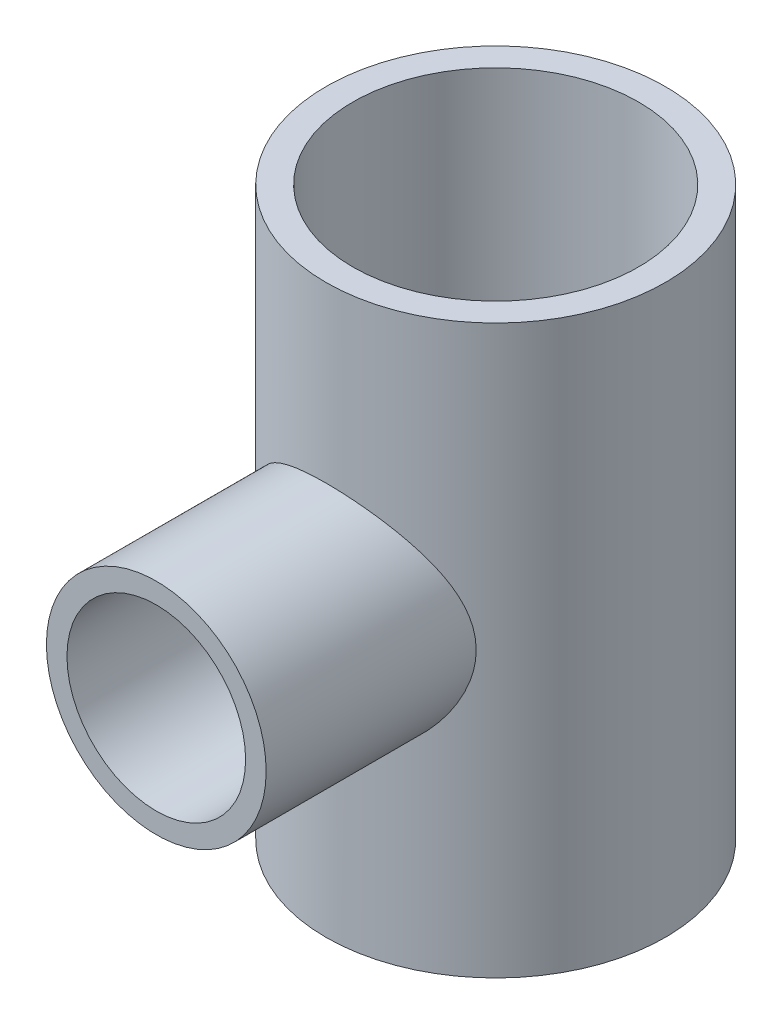
ISO-10303-21;
HEADER;
FILE_DESCRIPTION(('STEP AP214'),'2;1');
FILE_NAME('part.step','',(''),(''),'','','');
FILE_SCHEMA(('AUTOMOTIVE_DESIGN { 1 0 10303 214 1 1 1 1 }'));
ENDSEC;
DATA;
#1=APPLICATION_CONTEXT('core data for automotive mechanical design processes');
#2=APPLICATION_PROTOCOL_DEFINITION('international standard','automotive_design',2000,#1);
#3=PRODUCT_CONTEXT('',#1,'mechanical');
#4=PRODUCT('Part','Part','',(#3));
#5=PRODUCT_RELATED_PRODUCT_CATEGORY('part','',(#4));
#6=PRODUCT_DEFINITION_FORMATION('','',#4);
#7=PRODUCT_DEFINITION_CONTEXT('part definition',#1,'design');
#8=PRODUCT_DEFINITION('design','',#6,#7);
#9=PRODUCT_DEFINITION_SHAPE('','',#8);
#10=(LENGTH_UNIT() NAMED_UNIT(*) SI_UNIT(.MILLI.,.METRE.));
#11=(NAMED_UNIT(*) PLANE_ANGLE_UNIT() SI_UNIT($,.RADIAN.));
#12=(NAMED_UNIT(*) SI_UNIT($,.STERADIAN.) SOLID_ANGLE_UNIT());
#13=UNCERTAINTY_MEASURE_WITH_UNIT(LENGTH_MEASURE(1.E-05),#10,'distance_accuracy_value','');
#14=(GEOMETRIC_REPRESENTATION_CONTEXT(3) GLOBAL_UNCERTAINTY_ASSIGNED_CONTEXT((#13)) GLOBAL_UNIT_ASSIGNED_CONTEXT((#10,
#11,#12)) REPRESENTATION_CONTEXT('',''));
#15=CARTESIAN_POINT('',(0.,0.,0.));
#16=DIRECTION('',(0.,0.,1.));
#17=DIRECTION('',(1.,0.,0.));
#18=AXIS2_PLACEMENT_3D('',#15,#16,#17);
#19=CARTESIAN_POINT('',(0.,63.5,0.));
#20=DIRECTION('',(0.,-1.,0.));
#21=DIRECTION('',(0.,0.,-1.));
#22=AXIS2_PLACEMENT_3D('',#19,#20,#21);
#23=CYLINDRICAL_SURFACE('',#22,19.);
#24=CARTESIAN_POINT('',(0.,0.,0.));
#25=DIRECTION('',(0.,1.,0.));
#26=DIRECTION('',(0.,0.,1.));
#27=AXIS2_PLACEMENT_3D('',#24,#25,#26);
#28=CIRCLE('',#27,19.);
#29=CARTESIAN_POINT('',(0.,0.,19.));
#30=VERTEX_POINT('',#29);
#31=EDGE_CURVE('E50',#30,#30,#28,.T.);
#32=ORIENTED_EDGE('',*,*,#31,.T.);
#33=EDGE_LOOP('',(#32));
#34=FACE_BOUND('',#33,.T.);
#35=CARTESIAN_POINT('',(0.,63.5,0.));
#36=DIRECTION('',(0.,1.,0.));
#37=DIRECTION('',(0.,0.,1.));
#38=AXIS2_PLACEMENT_3D('',#35,#36,#37);
#39=CIRCLE('',#38,19.);
#40=CARTESIAN_POINT('',(0.,63.5,19.));
#41=VERTEX_POINT('',#40);
#42=EDGE_CURVE('E54',#41,#41,#39,.T.);
#43=ORIENTED_EDGE('',*,*,#42,.F.);
#44=EDGE_LOOP('',(#43));
#45=FACE_BOUND('',#44,.T.);
#46=CARTESIAN_POINT('',(-12.3,31.75,14.4813673387564));
#47=CARTESIAN_POINT('',(-12.2999965441653,31.4470628411877,14.4813729801498));
#48=CARTESIAN_POINT('',(-12.2887847818398,31.1440660838692,14.4909163526273));
#49=CARTESIAN_POINT('',(-12.2441618375185,30.5408498386601,14.5286379220476));
#50=CARTESIAN_POINT('',(-12.2107445239723,30.2406311410887,14.5568212659783));
#51=CARTESIAN_POINT('',(-12.1223113113468,29.6451754666948,14.6305457559861));
#52=CARTESIAN_POINT('',(-12.0672672050211,29.3499455232076,14.6761095686727));
#53=CARTESIAN_POINT('',(-11.9365034211611,28.7668402155524,14.7826581545976));
#54=CARTESIAN_POINT('',(-11.8607737151953,28.4789684928873,14.8436504065196));
#55=CARTESIAN_POINT('',(-11.6905212489713,27.9149416354675,14.9780951358322));
#56=CARTESIAN_POINT('',(-11.5961808960335,27.6387020945895,15.0514257297099));
#57=CARTESIAN_POINT('',(-11.3893543966854,27.0963011969436,15.2085340737555));
#58=CARTESIAN_POINT('',(-11.2768693601638,26.8301392249716,15.2923111848514));
#59=CARTESIAN_POINT('',(-10.9135226032184,26.0477647938694,15.5558416506181));
#60=CARTESIAN_POINT('',(-10.6366834571331,25.5473841042693,15.7478650510328));
#61=CARTESIAN_POINT('',(-10.1521881560604,24.7981019198013,16.0616782744371));
#62=CARTESIAN_POINT('',(-9.96546016273726,24.5330458791749,16.1784500475492));
#63=CARTESIAN_POINT('',(-9.57215270082651,24.0189882531166,16.4142129854929));
#64=CARTESIAN_POINT('',(-9.36557193697359,23.7699877169762,16.5332042947262));
#65=CARTESIAN_POINT('',(-8.93315675508671,23.2887067271312,16.7707973918588));
#66=CARTESIAN_POINT('',(-8.7073062025832,23.0564405911457,16.8893987652549));
#67=CARTESIAN_POINT('',(-8.23714588602806,22.6097279804795,17.1236214390501));
#68=CARTESIAN_POINT('',(-7.992834954319,22.3952826348052,17.2392425503201));
#69=CARTESIAN_POINT('',(-7.45268722558977,21.9579754520214,17.480164157135));
#70=CARTESIAN_POINT('',(-7.15432267923102,21.7378004117715,17.6047012106726));
#71=CARTESIAN_POINT('',(-6.5359910416335,21.3236255131673,17.8435048119737));
#72=CARTESIAN_POINT('',(-6.21602155093073,21.1296285693732,17.9577702156625));
#73=CARTESIAN_POINT('',(-5.55641003570782,20.7701433130271,18.1726858380199));
#74=CARTESIAN_POINT('',(-5.21678385748101,20.6046324525757,18.2733468114708));
#75=CARTESIAN_POINT('',(-4.51990440449267,20.3042874112258,18.4580689211724));
#76=CARTESIAN_POINT('',(-4.16265464928182,20.1694471351369,18.5421333552278));
#77=CARTESIAN_POINT('',(-3.47260794477938,19.9454197715416,18.6829166558941));
#78=CARTESIAN_POINT('',(-3.14129701661785,19.8528876137392,18.7416012526801));
#79=CARTESIAN_POINT('',(-2.46960367192137,19.6955405491316,18.8418764133178));
#80=CARTESIAN_POINT('',(-2.12922184418824,19.6307238479193,18.8834680838257));
#81=CARTESIAN_POINT('',(-1.44280724449313,19.5299949734138,18.9482726677421));
#82=CARTESIAN_POINT('',(-1.09678025109404,19.4940549291531,18.9715033023717));
#83=CARTESIAN_POINT('',(-0.402188800311309,19.4516564068566,18.9989206062062));
#84=CARTESIAN_POINT('',(-0.0536246745790616,19.4451941424515,19.0031097212607));
#85=CARTESIAN_POINT('',(0.592356536903332,19.460654993164,18.9931038783833));
#86=CARTESIAN_POINT('',(0.889918100537358,19.4786284599197,18.9814668715223));
#87=CARTESIAN_POINT('',(1.48207420531057,19.5359952410181,18.9444299867971));
#88=CARTESIAN_POINT('',(1.77666910152622,19.5753859601632,18.9190317764236));
#89=CARTESIAN_POINT('',(2.3608439546948,19.6750576372727,18.855046448322));
#90=CARTESIAN_POINT('',(2.65042370020848,19.7353394737684,18.81645877594));
#91=CARTESIAN_POINT('',(3.22269687510184,19.876034473052,18.7269355126553));
#92=CARTESIAN_POINT('',(3.50539000938623,19.9564484968567,18.6759993936351));
#93=CARTESIAN_POINT('',(4.06194787489373,20.1363859886305,18.5628969032959));
#94=CARTESIAN_POINT('',(4.3358218183331,20.2358887075355,18.5007427300998));
#95=CARTESIAN_POINT('',(4.8738130788328,20.4530914756661,18.3663513387657));
#96=CARTESIAN_POINT('',(5.13792640484075,20.5707988688605,18.2941100525217));
#97=CARTESIAN_POINT('',(5.65513560512632,20.8233238026711,18.1408980095289));
#98=CARTESIAN_POINT('',(5.90823324635509,20.958138585522,18.0599286600875));
#99=CARTESIAN_POINT('',(6.40260018479286,21.2438948393671,17.8906399061395));
#100=CARTESIAN_POINT('',(6.64386813053043,21.3948381467146,17.8023196649326));
#101=CARTESIAN_POINT('',(7.14404141300674,21.7322662642051,17.6080544468818));
#102=CARTESIAN_POINT('',(7.40123479861858,21.9208261462774,17.5013024270493));
#103=CARTESIAN_POINT('',(7.8988542973671,22.3160673114692,17.2824189618075));
#104=CARTESIAN_POINT('',(8.13927918622975,22.5227499152539,17.1702871246225));
#105=CARTESIAN_POINT('',(8.6030217576629,22.9535057649323,16.9426922120052));
#106=CARTESIAN_POINT('',(8.82631470563586,23.1776032487049,16.8272246395035));
#107=CARTESIAN_POINT('',(9.25479765503239,23.6420677436742,16.5954230084928));
#108=CARTESIAN_POINT('',(9.45998682570844,23.882435500589,16.4790889104858));
#109=CARTESIAN_POINT('',(9.87982998689617,24.4144871848656,16.2313459829906));
#110=CARTESIAN_POINT('',(10.0915910005652,24.7085759749477,16.1001791075852));
#111=CARTESIAN_POINT('',(10.4894450147039,25.3162261955913,15.8438493885788));
#112=CARTESIAN_POINT('',(10.6755326643705,25.629791665763,15.718687800125));
#113=CARTESIAN_POINT('',(11.0202932910258,26.2749016808647,15.4789264706374));
#114=CARTESIAN_POINT('',(11.1790051956677,26.606419800632,15.3643118421736));
#115=CARTESIAN_POINT('',(11.4674800120193,27.2864626373269,15.1502208874883));
#116=CARTESIAN_POINT('',(11.5972559971517,27.6349795869833,15.0507377312602));
#117=CARTESIAN_POINT('',(11.794293920424,28.2488544727548,14.8964990310505));
#118=CARTESIAN_POINT('',(11.8689281413511,28.5106664726509,14.8369721711531));
#119=CARTESIAN_POINT('',(12.0010855230456,29.0410188345662,14.7302807902069));
#120=CARTESIAN_POINT('',(12.0586131397398,29.3095574246487,14.6831130502367));
#121=CARTESIAN_POINT('',(12.1557279401009,29.8515848670728,14.6028167802588));
#122=CARTESIAN_POINT('',(12.1953381950566,30.1250668791322,14.5696701994965));
#123=CARTESIAN_POINT('',(12.2561053540993,30.6755057070604,14.5185904633979));
#124=CARTESIAN_POINT('',(12.2772620762716,30.9524625571567,14.500657458037));
#125=CARTESIAN_POINT('',(12.3007927442206,31.5086813078339,14.4807024356275));
#126=CARTESIAN_POINT('',(12.3031037482632,31.7879478169715,14.4787337369749));
#127=CARTESIAN_POINT('',(12.2887358273459,32.3456342910129,14.4909301604448));
#128=CARTESIAN_POINT('',(12.27205681097,32.624054251835,14.5050953602343));
#129=CARTESIAN_POINT('',(12.2199856739518,33.1780871367325,14.5489896348443));
#130=CARTESIAN_POINT('',(12.1845799458307,33.4536978708994,14.5787300269852));
#131=CARTESIAN_POINT('',(12.095624211079,33.9999948459899,14.6526176346315));
#132=CARTESIAN_POINT('',(12.0420738252584,34.2706809838738,14.6967651512187));
#133=CARTESIAN_POINT('',(11.9196576002343,34.796680031546,14.7962074922011));
#134=CARTESIAN_POINT('',(11.8513581274695,35.0522051264518,14.8510844093157));
#135=CARTESIAN_POINT('',(11.6992474998235,35.5561684287921,14.9712054858747));
#136=CARTESIAN_POINT('',(11.6154313135554,35.8046043072623,15.0364530070757));
#137=CARTESIAN_POINT('',(11.4330544994527,36.2934944202308,15.1755860126162));
#138=CARTESIAN_POINT('',(11.3344937240776,36.5339485748311,15.2494715833899));
#139=CARTESIAN_POINT('',(11.1233258949129,37.0062873766741,15.4041797156496));
#140=CARTESIAN_POINT('',(11.010718213176,37.2381716402107,15.4850025872074));
#141=CARTESIAN_POINT('',(10.7485533057664,37.7377450034568,15.6684068743337));
#142=CARTESIAN_POINT('',(10.5960872025739,38.0034885260567,15.7721380803309));
#143=CARTESIAN_POINT('',(10.2728343547611,38.52141504488,15.984563779803));
#144=CARTESIAN_POINT('',(10.1020497688331,38.7735996336727,16.0932576875967));
#145=CARTESIAN_POINT('',(9.74265431731175,39.2642034963578,16.3133422541566));
#146=CARTESIAN_POINT('',(9.55402246378952,39.5026060187963,16.424735970445));
#147=CARTESIAN_POINT('',(9.15972286970191,39.9647273714236,16.6478468678566));
#148=CARTESIAN_POINT('',(8.95405407209532,40.1884452889742,16.7595640686345));
#149=CARTESIAN_POINT('',(8.48537704137245,40.6617595295385,17.0023722950659));
#150=CARTESIAN_POINT('',(8.21891713496386,40.9081451656116,17.1330912908579));
#151=CARTESIAN_POINT('',(7.66353015528152,41.3776970586007,17.3886101167904));
#152=CARTESIAN_POINT('',(7.37459923630454,41.6008593257077,17.513408927837));
#153=CARTESIAN_POINT('',(6.77567068998116,42.0220097819637,17.7537126033053));
#154=CARTESIAN_POINT('',(6.46569086169671,42.2200188438269,17.8692251440732));
#155=CARTESIAN_POINT('',(5.82596027661867,42.5890241271459,18.0879064481372));
#156=CARTESIAN_POINT('',(5.49621506601364,42.7600278778243,18.1910786500315));
#157=CARTESIAN_POINT('',(4.88624939499021,43.0417637630919,18.3631179998726));
#158=CARTESIAN_POINT('',(4.6092049047786,43.1577205731176,18.4347283429388));
#159=CARTESIAN_POINT('',(4.04502417647392,43.3697482201105,18.5666813467845));
#160=CARTESIAN_POINT('',(3.7578897922669,43.46582268808,18.6270260647455));
#161=CARTESIAN_POINT('',(3.17529604183882,43.6369511794938,18.7351330573834));
#162=CARTESIAN_POINT('',(2.87984200920226,43.712018347249,18.7829031988824));
#163=CARTESIAN_POINT('',(2.28234066852151,43.8402553498791,18.864830730288));
#164=CARTESIAN_POINT('',(1.98029324267975,43.8934247931915,18.8989878767744));
#165=CARTESIAN_POINT('',(1.37068632283031,43.9772735378798,18.9529729325842));
#166=CARTESIAN_POINT('',(1.06311079578455,44.0078704699349,18.972748357895));
#167=CARTESIAN_POINT('',(0.445925945453609,44.0458015184583,18.9972767686916));
#168=CARTESIAN_POINT('',(0.136316621242779,44.0531356243382,19.0020297473398));
#169=CARTESIAN_POINT('',(-0.482445136489586,44.0444291952094,18.9963938390761));
#170=CARTESIAN_POINT('',(-0.791597550703744,44.0283876991912,18.9860043296317));
#171=CARTESIAN_POINT('',(-1.40694987466164,43.9731712148582,18.9503422158475));
#172=CARTESIAN_POINT('',(-1.71314987179558,43.9339969134134,18.9250700534104));
#173=CARTESIAN_POINT('',(-2.3028092930768,43.8359924093148,18.8621285167737));
#174=CARTESIAN_POINT('',(-2.58656474615433,43.7784203506866,18.8252545310279));
#175=CARTESIAN_POINT('',(-3.14759856538406,43.6439409691477,18.7396143109728));
#176=CARTESIAN_POINT('',(-3.4248772329562,43.5670345479966,18.6908486312983));
#177=CARTESIAN_POINT('',(-3.9713930981859,43.3947468250692,18.5824016320582));
#178=CARTESIAN_POINT('',(-4.24063107765125,43.2993673262515,18.5227213777787));
#179=CARTESIAN_POINT('',(-4.76988623189554,43.0910362925923,18.3935430301311));
#180=CARTESIAN_POINT('',(-5.02989997486938,42.9780783002788,18.3240413297141));
#181=CARTESIAN_POINT('',(-5.55759382274793,42.7269971213934,18.171236822976));
#182=CARTESIAN_POINT('',(-5.82451305592848,42.5876583640829,18.0873052453202));
#183=CARTESIAN_POINT('',(-6.34549740214023,42.2910891548871,17.9111786877292));
#184=CARTESIAN_POINT('',(-6.59955700449762,42.1338511249328,17.8189802113461));
#185=CARTESIAN_POINT('',(-7.09398737135075,41.8025585999229,17.6279779437743));
#186=CARTESIAN_POINT('',(-7.33435285929511,41.628497691485,17.5291716379413));
#187=CARTESIAN_POINT('',(-7.80065627243648,41.2645809343008,17.3266958535681));
#188=CARTESIAN_POINT('',(-8.02659270698364,41.0747234582789,17.2230258744799));
#189=CARTESIAN_POINT('',(-8.49728056980641,40.6495374552689,16.9963109472018));
#190=CARTESIAN_POINT('',(-8.73953763807083,40.4117176998288,16.8727492106992));
#191=CARTESIAN_POINT('',(-9.20332192516463,39.9172392108237,16.6243221642743));
#192=CARTESIAN_POINT('',(-9.42484613867527,39.6605777556631,16.4994566682733));
#193=CARTESIAN_POINT('',(-9.84643920064731,39.1292084233509,16.2513839527045));
#194=CARTESIAN_POINT('',(-10.0464975723891,38.8544918386512,16.1281775683127));
#195=CARTESIAN_POINT('',(-10.4240720592195,38.2879338607798,15.8867529948326));
#196=CARTESIAN_POINT('',(-10.6015916998168,37.996095156318,15.7685340275488));
#197=CARTESIAN_POINT('',(-10.912235438844,37.4335769367003,15.5548736438895));
#198=CARTESIAN_POINT('',(-11.048135234021,37.1648093088198,15.4584317874632));
#199=CARTESIAN_POINT('',(-11.3008570445159,36.6153922521183,15.2746537090938));
#200=CARTESIAN_POINT('',(-11.4176787615575,36.3347426376147,15.1873176295227));
#201=CARTESIAN_POINT('',(-11.6309022139007,35.7631010118559,15.0246487917227));
#202=CARTESIAN_POINT('',(-11.7273460234356,35.472131788254,14.9492913824887));
#203=CARTESIAN_POINT('',(-11.8988904046346,34.8806743742877,14.8131169919059));
#204=CARTESIAN_POINT('',(-11.9739982558443,34.5801894695327,14.7522950523746));
#205=CARTESIAN_POINT('',(-12.0809966212577,34.0702809477492,14.6646721369564));
#206=CARTESIAN_POINT('',(-12.1190041582868,33.8629137357725,14.6332340752604));
#207=CARTESIAN_POINT('',(-12.1844223215937,33.445427286625,14.5788090121747));
#208=CARTESIAN_POINT('',(-12.2118345185897,33.2353084621488,14.5558207581583));
#209=CARTESIAN_POINT('',(-12.2558062409216,32.8131333486607,14.5188169124771));
#210=CARTESIAN_POINT('',(-12.2723651168992,32.6010769444923,14.5048018576832));
#211=CARTESIAN_POINT('',(-12.2944624081868,32.1760234228151,14.4860757655088));
#212=CARTESIAN_POINT('',(-12.3000024301548,31.9630264469908,14.4813633717092));
#213=CARTESIAN_POINT('',(-12.3,31.75,14.4813673387564));
#214=B_SPLINE_CURVE_WITH_KNOTS('',3,(#46,#47,#48,#49,#50,#51,#52,#53,#54,#55,#56,#57,#58,#59,
#60,#61,#62,#63,#64,#65,#66,#67,#68,#69,#70,#71,#72,#73,#74,#75,#76,#77,#78,#79,#80,#81,#82,#83,
#84,#85,#86,#87,#88,#89,#90,#91,#92,#93,#94,#95,#96,#97,#98,#99,#100,#101,#102,#103,#104,#105,
#106,#107,#108,#109,#110,#111,#112,#113,#114,#115,#116,#117,#118,#119,#120,#121,#122,#123,#124,
#125,#126,#127,#128,#129,#130,#131,#132,#133,#134,#135,#136,#137,#138,#139,#140,#141,#142,#143,
#144,#145,#146,#147,#148,#149,#150,#151,#152,#153,#154,#155,#156,#157,#158,#159,#160,#161,#162,
#163,#164,#165,#166,#167,#168,#169,#170,#171,#172,#173,#174,#175,#176,#177,#178,#179,#180,#181,
#182,#183,#184,#185,#186,#187,#188,#189,#190,#191,#192,#193,#194,#195,#196,#197,#198,#199,#200,
#201,#202,#203,#204,#205,#206,#207,#208,#209,#210,#211,#212,#213),.UNSPECIFIED.,.T.,.F.,(4,2,2,
2,2,2,2,2,2,2,2,2,2,2,2,2,2,2,2,2,2,2,2,2,2,2,2,2,2,2,2,2,2,2,2,2,2,2,2,2,2,2,2,2,2,2,2,2,2,2,2,
2,2,2,2,2,2,2,2,2,2,2,2,2,2,2,2,2,2,2,2,2,2,2,2,2,2,2,2,2,2,2,2,4),(0.,0.908563565099244,
1.81737811336662,2.72738196010969,3.63782776446964,4.5397576667271,5.44163241991294,
7.24448738837565,8.27759342367578,9.31076690830666,10.3448141150993,11.3789267823701,
12.5508497435094,13.7229030742007,14.8940243669467,16.0649127180523,17.1102390723158,
18.1554977378088,19.199746331938,20.2438607903788,21.1377741091981,22.0315791337869,
22.9254217499977,23.8193026007488,24.7122172689097,25.6054930929258,26.4986251005547,
27.3918589065184,28.3997620362087,29.407738676407,30.4171442393922,31.4265960979924,
32.5814315637297,33.7365073560644,34.8899268696099,36.042824200531,36.8780589199961,
37.7130758866331,38.5470145614849,39.3809614572033,40.2176924683805,41.0544275075138,
41.89177138435,42.7291327612179,43.5387439781375,44.3486181776024,45.1585004815516,
45.9684190031386,46.9378905033389,47.9072478840401,48.8777597184306,49.8483318124816,
51.004152940199,52.1601723130021,53.3152260389079,54.4699571590512,55.3952766422218,
56.320426989984,57.2449971683556,58.16958387864,59.0975280308654,60.0254726054575,
60.9534553304514,61.881410502734,62.756069339237,63.6306873889939,64.5052201196513,
65.3800748721903,66.3168781893267,67.2540796092325,68.1916397382271,69.1292965693785,
70.2119705189532,71.2948011646116,72.3781579205088,73.4613450083997,74.4092005186666,
75.3570708467625,76.3029645598514,77.2485351578854,77.887589893881,78.5265498561108,
79.1655480440656,79.8044530529368),.UNSPECIFIED.);
#215=CARTESIAN_POINT('',(-12.3,31.75,14.4813673387564));
#216=VERTEX_POINT('',#215);
#217=EDGE_CURVE('E11',#216,#216,#214,.T.);
#218=ORIENTED_EDGE('',*,*,#217,.F.);
#219=EDGE_LOOP('',(#218));
#220=FACE_BOUND('',#219,.T.);
#221=ADVANCED_FACE('F46',(#34,#45,#220),#23,.T.);
#222=CARTESIAN_POINT('',(0.,63.5,0.));
#223=DIRECTION('',(0.,1.,0.));
#224=DIRECTION('',(0.,0.,1.));
#225=AXIS2_PLACEMENT_3D('',#222,#223,#224);
#226=PLANE('',#225);
#227=ORIENTED_EDGE('',*,*,#42,.T.);
#228=EDGE_LOOP('',(#227));
#229=FACE_BOUND('',#228,.T.);
#230=CARTESIAN_POINT('',(0.,63.5,0.));
#231=DIRECTION('',(0.,1.,0.));
#232=DIRECTION('',(0.,0.,1.));
#233=AXIS2_PLACEMENT_3D('',#230,#231,#232);
#234=CIRCLE('',#233,16.);
#235=CARTESIAN_POINT('',(0.,63.5,16.));
#236=VERTEX_POINT('',#235);
#237=EDGE_CURVE('E67',#236,#236,#234,.T.);
#238=ORIENTED_EDGE('',*,*,#237,.F.);
#239=EDGE_LOOP('',(#238));
#240=FACE_BOUND('',#239,.T.);
#241=ADVANCED_FACE('F83',(#229,#240),#226,.T.);
#242=CARTESIAN_POINT('',(0.,0.,0.));
#243=DIRECTION('',(0.,1.,0.));
#244=DIRECTION('',(0.,0.,1.));
#245=AXIS2_PLACEMENT_3D('',#242,#243,#244);
#246=PLANE('',#245);
#247=ORIENTED_EDGE('',*,*,#31,.F.);
#248=EDGE_LOOP('',(#247));
#249=FACE_BOUND('',#248,.T.);
#250=CARTESIAN_POINT('',(0.,0.,0.));
#251=DIRECTION('',(0.,1.,0.));
#252=DIRECTION('',(0.,0.,1.));
#253=AXIS2_PLACEMENT_3D('',#250,#251,#252);
#254=CIRCLE('',#253,16.);
#255=CARTESIAN_POINT('',(0.,0.,16.));
#256=VERTEX_POINT('',#255);
#257=EDGE_CURVE('E104',#256,#256,#254,.T.);
#258=ORIENTED_EDGE('',*,*,#257,.T.);
#259=EDGE_LOOP('',(#258));
#260=FACE_BOUND('',#259,.T.);
#261=ADVANCED_FACE('F75',(#249,#260),#246,.F.);
#262=CARTESIAN_POINT('',(0.,31.75,38.));
#263=DIRECTION('',(0.,0.,-1.));
#264=DIRECTION('',(-1.,0.,0.));
#265=AXIS2_PLACEMENT_3D('',#262,#263,#264);
#266=CYLINDRICAL_SURFACE('',#265,12.3);
#267=CARTESIAN_POINT('',(0.,31.75,38.));
#268=DIRECTION('',(0.,0.,1.));
#269=DIRECTION('',(1.,0.,0.));
#270=AXIS2_PLACEMENT_3D('',#267,#268,#269);
#271=CIRCLE('',#270,12.3);
#272=CARTESIAN_POINT('',(12.3,31.75,38.));
#273=VERTEX_POINT('',#272);
#274=EDGE_CURVE('E65',#273,#273,#271,.T.);
#275=ORIENTED_EDGE('',*,*,#274,.F.);
#276=EDGE_LOOP('',(#275));
#277=FACE_BOUND('',#276,.T.);
#278=ORIENTED_EDGE('',*,*,#217,.T.);
#279=EDGE_LOOP('',(#278));
#280=FACE_BOUND('',#279,.T.);
#281=ADVANCED_FACE('F69',(#277,#280),#266,.T.);
#282=CARTESIAN_POINT('',(0.,31.75,38.));
#283=DIRECTION('',(0.,0.,-1.));
#284=DIRECTION('',(-1.,0.,0.));
#285=AXIS2_PLACEMENT_3D('',#282,#283,#284);
#286=CYLINDRICAL_SURFACE('',#285,10.);
#287=CARTESIAN_POINT('',(0.,31.75,38.));
#288=DIRECTION('',(0.,0.,1.));
#289=DIRECTION('',(1.,0.,0.));
#290=AXIS2_PLACEMENT_3D('',#287,#288,#289);
#291=CIRCLE('',#290,10.);
#292=CARTESIAN_POINT('',(10.,31.75,38.));
#293=VERTEX_POINT('',#292);
#294=EDGE_CURVE('E108',#293,#293,#291,.T.);
#295=ORIENTED_EDGE('',*,*,#294,.T.);
#296=EDGE_LOOP('',(#295));
#297=FACE_BOUND('',#296,.T.);
#298=CARTESIAN_POINT('',(10.,31.75,12.4899959967968));
#299=CARTESIAN_POINT('',(9.9999974881735,31.9986196323667,12.4900000041844));
#300=CARTESIAN_POINT('',(9.99070990534612,32.2472869819416,12.4974515824784));
#301=CARTESIAN_POINT('',(9.95372736207024,32.7424855328345,12.5269249763803));
#302=CARTESIAN_POINT('',(9.92602155997176,32.9890153893067,12.5489553735893));
#303=CARTESIAN_POINT('',(9.8526351327322,33.4782627715163,12.6066551218423));
#304=CARTESIAN_POINT('',(9.80691824871058,33.7209715735005,12.6423519813087));
#305=CARTESIAN_POINT('',(9.69823613948705,34.2004481454764,12.7259146587793));
#306=CARTESIAN_POINT('',(9.63526229138831,34.4372128806242,12.7737865595013));
#307=CARTESIAN_POINT('',(9.49358726466931,34.9012046981026,12.8794221236938));
#308=CARTESIAN_POINT('',(9.41503650215901,35.1284996079966,12.9370904793504));
#309=CARTESIAN_POINT('',(9.24268870570662,35.574922504235,13.0607803968391));
#310=CARTESIAN_POINT('',(9.14888467553425,35.794046685938,13.1268057887065));
#311=CARTESIAN_POINT('',(8.84582537405096,36.4378710149199,13.3345844667175));
#312=CARTESIAN_POINT('',(8.61478490360618,36.8494682004879,13.4861479900674));
#313=CARTESIAN_POINT('',(8.21173263923688,37.4629850546891,13.7330570765294));
#314=CARTESIAN_POINT('',(8.05741214846499,37.6785946384107,13.8243640665401));
#315=CARTESIAN_POINT('',(7.73250361508823,38.0965249201615,14.0086839192331));
#316=CARTESIAN_POINT('',(7.56191522360874,38.2988453330395,14.1016968184652));
#317=CARTESIAN_POINT('',(7.20501476111525,38.6895859657894,14.2873464706795));
#318=CARTESIAN_POINT('',(7.01869072305957,38.8779953984493,14.3799828801929));
#319=CARTESIAN_POINT('',(6.63098942534321,39.2400151312197,14.5628267942414));
#320=CARTESIAN_POINT('',(6.42960925681394,39.4136225576191,14.6530338248134));
#321=CARTESIAN_POINT('',(5.98717220977541,39.7651713099615,14.839749792651));
#322=CARTESIAN_POINT('',(5.74426400939051,39.9410904656081,14.9356985668772));
#323=CARTESIAN_POINT('',(5.24155045683266,40.2715359151965,15.1194487549426));
#324=CARTESIAN_POINT('',(4.98175281823309,40.4260718755614,15.2072538442335));
#325=CARTESIAN_POINT('',(4.44667927077069,40.7120875642736,15.3722273216394));
#326=CARTESIAN_POINT('',(4.17141076978118,40.8435782052071,15.4494007404154));
#327=CARTESIAN_POINT('',(3.60716284391012,41.0817791197775,15.5907956596746));
#328=CARTESIAN_POINT('',(3.31818592396523,41.1884938998568,15.6550195152535));
#329=CARTESIAN_POINT('',(2.75887473691586,41.3659102520284,15.7626547815692));
#330=CARTESIAN_POINT('',(2.48963039456118,41.4391695668337,15.8075179828027));
#331=CARTESIAN_POINT('',(1.94413024464245,41.5631832809024,15.883833622935));
#332=CARTESIAN_POINT('',(1.66787486981816,41.6139390655899,15.9152868874087));
#333=CARTESIAN_POINT('',(1.11106895242679,41.6920567762992,15.9638202407536));
#334=CARTESIAN_POINT('',(0.830522391374407,41.7194391903095,15.9809129172282));
#335=CARTESIAN_POINT('',(0.267620095065898,41.7503901300824,16.0002390802691));
#336=CARTESIAN_POINT('',(-0.01473542820398,41.7539613968878,16.0024742771681));
#337=CARTESIAN_POINT('',(-0.540516803994204,41.7383651558066,15.9927302912069));
#338=CARTESIAN_POINT('',(-0.784073317305023,41.7221899354668,15.9826215866946));
#339=CARTESIAN_POINT('',(-1.2686628814647,41.672188016572,15.9514710745788));
#340=CARTESIAN_POINT('',(-1.50969595909628,41.6383615055549,15.9304293831338));
#341=CARTESIAN_POINT('',(-1.98753869940023,41.5534984815078,15.8778926373011));
#342=CARTESIAN_POINT('',(-2.22434840765214,41.5024621543284,15.8463976957993));
#343=CARTESIAN_POINT('',(-2.69223846355506,41.3838003410159,15.7736461615169));
#344=CARTESIAN_POINT('',(-2.92331856948056,41.3161741562818,15.7323891576574));
#345=CARTESIAN_POINT('',(-3.37893591395846,41.1649108694438,15.6408731645953));
#346=CARTESIAN_POINT('',(-3.60345698828556,41.0812375205003,15.5905938128574));
#347=CARTESIAN_POINT('',(-4.04435674582464,40.8987772278425,15.4820781852073));
#348=CARTESIAN_POINT('',(-4.2607326981593,40.7999852704512,15.4238392704092));
#349=CARTESIAN_POINT('',(-4.68430149600748,40.58817738737,15.3005218017216));
#350=CARTESIAN_POINT('',(-4.89149632638181,40.4751645565681,15.2354447365251));
#351=CARTESIAN_POINT('',(-5.29608217185732,40.2356821499415,15.0995720650965));
#352=CARTESIAN_POINT('',(-5.49346964067703,40.1092077576996,15.0287744142906));
#353=CARTESIAN_POINT('',(-5.90162547629849,39.8271132133708,14.8736076950159));
#354=CARTESIAN_POINT('',(-6.11101555428877,39.6698238132982,14.7886446347732));
#355=CARTESIAN_POINT('',(-6.51595257187433,39.3401625169803,14.6147510187895));
#356=CARTESIAN_POINT('',(-6.71149316268051,39.1677837835103,14.5258186735392));
#357=CARTESIAN_POINT('',(-7.0882635821326,38.8086354518011,14.3457367718477));
#358=CARTESIAN_POINT('',(-7.2694763419688,38.6218491977245,14.2545847351826));
#359=CARTESIAN_POINT('',(-7.6167668225375,38.2347882701473,14.0720769892041));
#360=CARTESIAN_POINT('',(-7.78284385403362,38.0345129831173,13.9807212708096));
#361=CARTESIAN_POINT('',(-8.11995427430991,37.5940553648469,13.7879945073376));
#362=CARTESIAN_POINT('',(-8.28879676465043,37.3520789291197,13.6868756498205));
#363=CARTESIAN_POINT('',(-8.60535254315009,36.8524864131717,13.4900947328486));
#364=CARTESIAN_POINT('',(-8.75306186161697,36.5948674075346,13.3944337006251));
#365=CARTESIAN_POINT('',(-9.0258612496225,36.0653669349193,13.2121424234307));
#366=CARTESIAN_POINT('',(-9.15098489786775,35.7935074291938,13.1254988545428));
#367=CARTESIAN_POINT('',(-9.37734695882143,35.2364938110784,12.9647468052774));
#368=CARTESIAN_POINT('',(-9.47859556589513,34.9513454353976,12.8906329786857));
#369=CARTESIAN_POINT('',(-9.63228424138721,34.4461668510599,12.7759819057403));
#370=CARTESIAN_POINT('',(-9.69055753909834,34.2287368805524,12.7317405821278));
#371=CARTESIAN_POINT('',(-9.79257961225864,33.7887144756712,12.6534394794449));
#372=CARTESIAN_POINT('',(-9.83633191058146,33.5661233074725,12.6193772310754));
#373=CARTESIAN_POINT('',(-9.90868711929688,33.1173062240693,12.5626445998415));
#374=CARTESIAN_POINT('',(-9.93730709447091,32.8910847008614,12.5399613862794));
#375=CARTESIAN_POINT('',(-9.97903357464219,32.4363108096146,12.5067824015427));
#376=CARTESIAN_POINT('',(-9.99213983383472,32.2077584047023,12.4962868234732));
#377=CARTESIAN_POINT('',(-10.002631645051,31.7495311956738,12.4878904396978));
#378=CARTESIAN_POINT('',(-9.99998090794016,31.5198550188053,12.4900187073026));
#379=CARTESIAN_POINT('',(-9.97891922073934,31.0616953917687,12.5068520902638));
#380=CARTESIAN_POINT('',(-9.96050818092811,30.8332119483981,12.5215572772189));
#381=CARTESIAN_POINT('',(-9.90820857011519,30.3789736574504,12.5629816792017));
#382=CARTESIAN_POINT('',(-9.87430897476346,30.1532208711661,12.5897094513819));
#383=CARTESIAN_POINT('',(-9.79153520196052,29.7060961135886,12.6541922443476));
#384=CARTESIAN_POINT('',(-9.74266065390798,29.4847242508593,12.691947538042));
#385=CARTESIAN_POINT('',(-9.63151252535693,29.0512624601295,12.7764920563798));
#386=CARTESIAN_POINT('',(-9.56947840413349,28.8390790071441,12.8231184705436));
#387=CARTESIAN_POINT('',(-9.43218251593094,28.4209785012643,12.9244422348934));
#388=CARTESIAN_POINT('',(-9.35691626016088,28.2150636027755,12.9791423229312));
#389=CARTESIAN_POINT('',(-9.11226382200143,27.60789872932,13.153201676435));
#390=CARTESIAN_POINT('',(-8.92396766615127,27.2170124208566,13.2825646900574));
#391=CARTESIAN_POINT('',(-8.46117866412097,26.3954468883195,13.5830059230371));
#392=CARTESIAN_POINT('',(-8.17710027863874,25.9713603009754,13.7573371164264));
#393=CARTESIAN_POINT('',(-7.70650787857834,25.3723566744543,14.0229248463603));
#394=CARTESIAN_POINT('',(-7.54208197824594,25.1787365955236,14.1122089373249));
#395=CARTESIAN_POINT('',(-7.1988074232826,24.8043784213483,14.2903645312329));
#396=CARTESIAN_POINT('',(-7.01995622806563,24.6236426058886,14.3792359585703));
#397=CARTESIAN_POINT('',(-6.61853709405917,24.2478518300461,14.5688657371762));
#398=CARTESIAN_POINT('',(-6.39356317470302,24.0551649707535,14.6692385805943));
#399=CARTESIAN_POINT('',(-5.9259421993176,23.689525214389,14.8642980744416));
#400=CARTESIAN_POINT('',(-5.68330182252758,23.5165649220261,14.9589868494231));
#401=CARTESIAN_POINT('',(-5.1813543032731,23.1917928929628,15.1401700701514));
#402=CARTESIAN_POINT('',(-4.92204798806822,23.0399801077307,15.2266649220997));
#403=CARTESIAN_POINT('',(-4.388179611103,22.7591820008053,15.3890118148309));
#404=CARTESIAN_POINT('',(-4.11361947970968,22.630193799273,15.4648651980259));
#405=CARTESIAN_POINT('',(-3.56786365956705,22.4037522976757,15.5995053057728));
#406=CARTESIAN_POINT('',(-3.29744348206384,22.3048772913647,15.6590399648422));
#407=CARTESIAN_POINT('',(-2.74669957648999,22.1302771889616,15.764968924689));
#408=CARTESIAN_POINT('',(-2.4663760813864,22.0545515487046,15.8113635343435));
#409=CARTESIAN_POINT('',(-1.89856971065979,21.9275784765588,15.8895394236375));
#410=CARTESIAN_POINT('',(-1.6110954615121,21.8763029249394,15.9213374889943));
#411=CARTESIAN_POINT('',(-1.03149579494383,21.7990479870043,15.9693619619107));
#412=CARTESIAN_POINT('',(-0.739371155079602,21.7730644160356,15.9855909454268));
#413=CARTESIAN_POINT('',(-0.196855514467576,21.7488139861245,16.0007394789536));
#414=CARTESIAN_POINT('',(0.0533245708604662,21.7470192232816,16.0018622072223));
#415=CARTESIAN_POINT('',(0.552874802723456,21.7621698295847,15.9923954388796));
#416=CARTESIAN_POINT('',(0.80224504210317,21.7791129685593,15.9818073360829));
#417=CARTESIAN_POINT('',(1.29825515680178,21.8314954138223,15.9491791649137));
#418=CARTESIAN_POINT('',(1.54489515466487,21.8669338865002,15.9271396126744));
#419=CARTESIAN_POINT('',(2.0336648495585,21.9558227014687,15.8721356667476));
#420=CARTESIAN_POINT('',(2.27579445256111,22.009273418817,15.8391710455747));
#421=CARTESIAN_POINT('',(2.74553606689373,22.1313279898754,15.7644096149276));
#422=CARTESIAN_POINT('',(2.97335954366326,22.1993356846829,15.7229625035471));
#423=CARTESIAN_POINT('',(3.42211102636837,22.3507842049544,15.6314304294612));
#424=CARTESIAN_POINT('',(3.64303661493914,22.4342303714279,15.5813424778243));
#425=CARTESIAN_POINT('',(4.07678471458921,22.6157192586996,15.4735179895821));
#426=CARTESIAN_POINT('',(4.28960951885556,22.7137578094806,15.4157836385806));
#427=CARTESIAN_POINT('',(4.70642530840254,22.9236735790488,15.2936832633333));
#428=CARTESIAN_POINT('',(4.91041306433914,23.0355558001194,15.229314843339));
#429=CARTESIAN_POINT('',(5.32938081352856,23.2845956783133,15.0881239075121));
#430=CARTESIAN_POINT('',(5.54331665483516,23.423170606464,15.0107018315535));
#431=CARTESIAN_POINT('',(5.95880859750514,23.7152550590816,14.8506630853186));
#432=CARTESIAN_POINT('',(6.16035919729968,23.868771143341,14.7680441390806));
#433=CARTESIAN_POINT('',(6.55053004398355,24.189943458762,14.5991704843148));
#434=CARTESIAN_POINT('',(6.73913968495412,24.3576110428206,14.5129128850006));
#435=CARTESIAN_POINT('',(7.10271890487881,24.7062208097569,14.338481375595));
#436=CARTESIAN_POINT('',(7.27768746254364,24.887163984595,14.2503073226521));
#437=CARTESIAN_POINT('',(7.63769059883068,25.2886920057443,14.0610374314401));
#438=CARTESIAN_POINT('',(7.82053747437775,25.5112304063492,13.959912037829));
#439=CARTESIAN_POINT('',(8.16688197953981,25.9720138247938,13.7601604587044));
#440=CARTESIAN_POINT('',(8.33037609815685,26.2102616804893,13.6615347292255));
#441=CARTESIAN_POINT('',(8.63691543308306,26.7014892611261,13.4698312169207));
#442=CARTESIAN_POINT('',(8.7799727118007,26.9544601709578,13.3767501805329));
#443=CARTESIAN_POINT('',(9.04459872660319,27.4744509733563,13.1992663201228));
#444=CARTESIAN_POINT('',(9.16616350865137,27.7414734393273,13.1148650941425));
#445=CARTESIAN_POINT('',(9.36210810569558,28.2280985030882,12.9754401661067));
#446=CARTESIAN_POINT('',(9.44098547612814,28.445216243196,12.9180376912907));
#447=CARTESIAN_POINT('',(9.58399125211479,28.8862944333221,12.8122996653933));
#448=CARTESIAN_POINT('',(9.64812863355305,29.1102506244397,12.7639585997112));
#449=CARTESIAN_POINT('',(9.76081533920515,29.5634781239797,12.6779928554624));
#450=CARTESIAN_POINT('',(9.8094026732095,29.7927349803614,12.6403420719246));
#451=CARTESIAN_POINT('',(9.89049984896281,30.2556218368217,12.5769900755909));
#452=CARTESIAN_POINT('',(9.92301796373962,30.4892495221994,12.5512827142887));
#453=CARTESIAN_POINT('',(9.96477993316754,30.8942083047985,12.5181325655945));
#454=CARTESIAN_POINT('',(9.97797383813558,31.0648929123896,12.5076043967842));
#455=CARTESIAN_POINT('',(9.99558584129878,31.4070439885624,12.4935338519185));
#456=CARTESIAN_POINT('',(10.0000017325724,31.5785106429045,12.4899932326373));
#457=CARTESIAN_POINT('',(10.,31.75,12.4899959967968));
#458=B_SPLINE_CURVE_WITH_KNOTS('',3,(#298,#299,#300,#301,#302,#303,#304,#305,#306,#307,#308,
#309,#310,#311,#312,#313,#314,#315,#316,#317,#318,#319,#320,#321,#322,#323,#324,#325,#326,#327,
#328,#329,#330,#331,#332,#333,#334,#335,#336,#337,#338,#339,#340,#341,#342,#343,#344,#345,#346,
#347,#348,#349,#350,#351,#352,#353,#354,#355,#356,#357,#358,#359,#360,#361,#362,#363,#364,#365,
#366,#367,#368,#369,#370,#371,#372,#373,#374,#375,#376,#377,#378,#379,#380,#381,#382,#383,#384,
#385,#386,#387,#388,#389,#390,#391,#392,#393,#394,#395,#396,#397,#398,#399,#400,#401,#402,#403,
#404,#405,#406,#407,#408,#409,#410,#411,#412,#413,#414,#415,#416,#417,#418,#419,#420,#421,#422,
#423,#424,#425,#426,#427,#428,#429,#430,#431,#432,#433,#434,#435,#436,#437,#438,#439,#440,#441,
#442,#443,#444,#445,#446,#447,#448,#449,#450,#451,#452,#453,#454,#455,#456,#457),.UNSPECIFIED.,
.T.,.F.,(4,2,2,2,2,2,2,2,2,2,2,2,2,2,2,2,2,2,2,2,2,2,2,2,2,2,2,2,2,2,2,2,2,2,2,2,2,2,2,2,2,2,2,
2,2,2,2,2,2,2,2,2,2,2,2,2,2,2,2,2,2,2,2,2,2,2,2,2,2,2,2,2,2,2,2,2,2,2,2,4),(0.,
0.745661263434783,1.49176183997798,2.23937216227234,2.98735673107549,3.72844236581738,
4.46986887879306,5.95130050477196,6.79197464317808,7.63266681438737,8.47400419529454,
9.31550454608166,10.2589332600165,11.2019340872527,12.1444871643168,13.0868686673397,
13.9334798376168,14.7800388792574,15.6258551031258,16.4715739583719,17.2036008107527,
17.9356198858026,18.6676310559527,19.3996730564682,20.1333884715698,20.8673477329023,
21.6011475380906,22.3352107780209,23.1603492336101,23.9858635277275,24.8123468898907,
25.6388678688816,26.5734513502042,27.5082101554951,28.441567573751,29.3745257346466,
30.0620841547588,30.7494756473079,31.4360903034158,32.12271583834,32.8109233172384,
33.4991347140324,34.1878367267113,34.8765557848206,35.5536786702308,36.2310317036032,
37.5850608351621,39.1968814050108,40.0040834617486,40.8114279948267,41.748545574165,
42.6853106747088,43.6220293122044,44.558629676994,45.4393847265783,46.3201190709342,
47.199838036345,48.0794114242052,48.829028604394,49.5785565752938,50.328050766838,
51.0775605655923,51.8008247489417,52.5243396183052,53.2476481267849,53.9712187636323,
54.7696020100402,55.5683373750338,56.3677197214293,57.1671618591305,58.0819031457016,
58.9968101320919,59.9111748631186,60.8257076378157,61.539130140545,62.2521170482241,
62.9633476130057,63.6742116275301,64.1884141161294,64.7027458664429),.UNSPECIFIED.);
#459=CARTESIAN_POINT('',(10.,31.75,12.4899959967968));
#460=VERTEX_POINT('',#459);
#461=EDGE_CURVE('E112',#460,#460,#458,.T.);
#462=ORIENTED_EDGE('',*,*,#461,.F.);
#463=EDGE_LOOP('',(#462));
#464=FACE_BOUND('',#463,.T.);
#465=ADVANCED_FACE('F74',(#297,#464),#286,.F.);
#466=CARTESIAN_POINT('',(0.,31.75,38.));
#467=DIRECTION('',(0.,0.,1.));
#468=DIRECTION('',(1.,0.,0.));
#469=AXIS2_PLACEMENT_3D('',#466,#467,#468);
#470=PLANE('',#469);
#471=ORIENTED_EDGE('',*,*,#274,.T.);
#472=EDGE_LOOP('',(#471));
#473=FACE_BOUND('',#472,.T.);
#474=ORIENTED_EDGE('',*,*,#294,.F.);
#475=EDGE_LOOP('',(#474));
#476=FACE_BOUND('',#475,.T.);
#477=ADVANCED_FACE('F77',(#473,#476),#470,.T.);
#478=CARTESIAN_POINT('',(0.,63.5,0.));
#479=DIRECTION('',(0.,-1.,0.));
#480=DIRECTION('',(0.,0.,-1.));
#481=AXIS2_PLACEMENT_3D('',#478,#479,#480);
#482=CYLINDRICAL_SURFACE('',#481,16.);
#483=ORIENTED_EDGE('',*,*,#461,.T.);
#484=EDGE_LOOP('',(#483));
#485=FACE_BOUND('',#484,.T.);
#486=ORIENTED_EDGE('',*,*,#237,.T.);
#487=EDGE_LOOP('',(#486));
#488=FACE_BOUND('',#487,.T.);
#489=ORIENTED_EDGE('',*,*,#257,.F.);
#490=EDGE_LOOP('',(#489));
#491=FACE_BOUND('',#490,.T.);
#492=ADVANCED_FACE('F79',(#485,#488,#491),#482,.F.);
#493=CLOSED_SHELL('',(#221,#241,#261,#281,#465,#477,#492));
#494=MANIFOLD_SOLID_BREP('B2',#493);
#495=ADVANCED_BREP_SHAPE_REPRESENTATION('',(#18,#494),#14);
#496=SHAPE_DEFINITION_REPRESENTATION(#9,#495);
ENDSEC;
END-ISO-10303-21;
